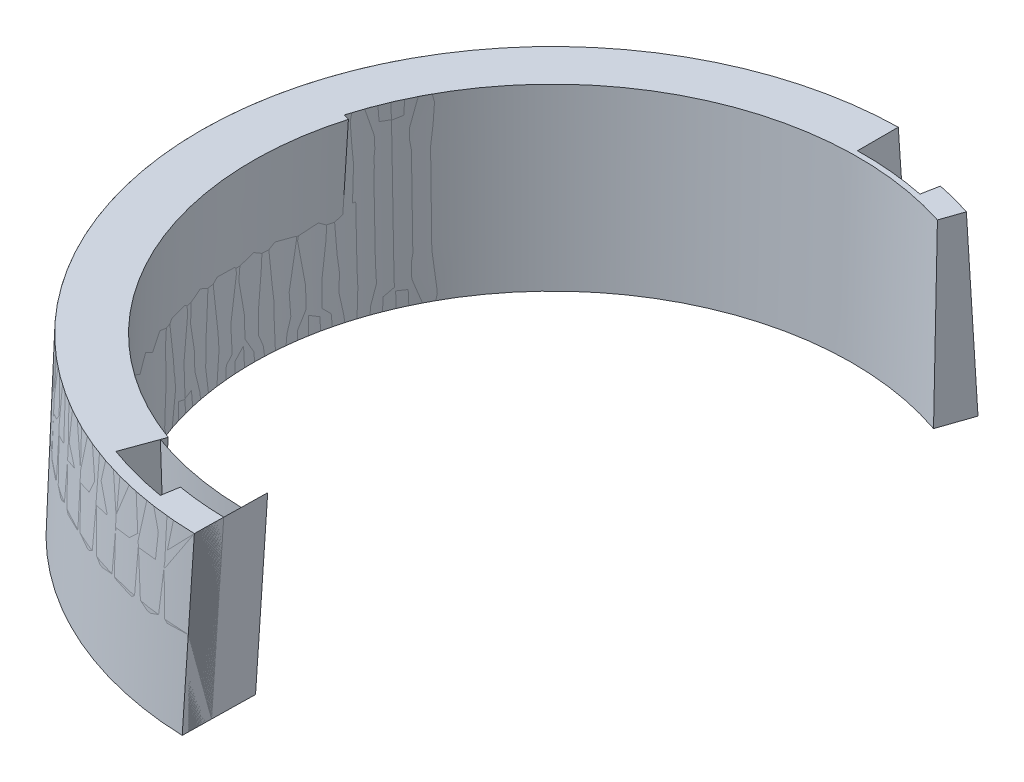
ISO-10303-21;
HEADER;
FILE_DESCRIPTION(('STEP AP214'),'2;1');
FILE_NAME('part.step','',(''),(''),'','','');
FILE_SCHEMA(('AUTOMOTIVE_DESIGN { 1 0 10303 214 1 1 1 1 }'));
ENDSEC;
DATA;
#1=APPLICATION_CONTEXT('core data for automotive mechanical design processes');
#2=APPLICATION_PROTOCOL_DEFINITION('international standard','automotive_design',2000,#1);
#3=PRODUCT_CONTEXT('',#1,'mechanical');
#4=PRODUCT('Part','Part','',(#3));
#5=PRODUCT_RELATED_PRODUCT_CATEGORY('part','',(#4));
#6=PRODUCT_DEFINITION_FORMATION('','',#4);
#7=PRODUCT_DEFINITION_CONTEXT('part definition',#1,'design');
#8=PRODUCT_DEFINITION('design','',#6,#7);
#9=PRODUCT_DEFINITION_SHAPE('','',#8);
#10=(LENGTH_UNIT() NAMED_UNIT(*) SI_UNIT(.MILLI.,.METRE.));
#11=(NAMED_UNIT(*) PLANE_ANGLE_UNIT() SI_UNIT($,.RADIAN.));
#12=(NAMED_UNIT(*) SI_UNIT($,.STERADIAN.) SOLID_ANGLE_UNIT());
#13=UNCERTAINTY_MEASURE_WITH_UNIT(LENGTH_MEASURE(1.E-05),#10,'distance_accuracy_value','');
#14=(GEOMETRIC_REPRESENTATION_CONTEXT(3) GLOBAL_UNCERTAINTY_ASSIGNED_CONTEXT((#13)) GLOBAL_UNIT_ASSIGNED_CONTEXT((#10,
#11,#12)) REPRESENTATION_CONTEXT('',''));
#15=CARTESIAN_POINT('',(0.,0.,0.));
#16=DIRECTION('',(0.,0.,1.));
#17=DIRECTION('',(1.,0.,0.));
#18=AXIS2_PLACEMENT_3D('',#15,#16,#17);
#19=CARTESIAN_POINT('',(-1.90318188336964,0.,49.0057882774836));
#20=DIRECTION('',(-0.999238614955483,0.034899496702501,-0.0174417749028301));
#21=DIRECTION('',(-0.0174524064372834,0.,0.999847695156391));
#22=AXIS2_PLACEMENT_3D('',#19,#20,#21);
#23=PLANE('',#22);
#24=CARTESIAN_POINT('',(-2.1189524065532,-0.000199999999995899,61.3668730888602));
#25=DIRECTION('',(0.0354768345270249,0.998793085918968,-0.0339671272321782));
#26=VECTOR('',#25,1.);
#27=LINE('',#24,#26);
#28=CARTESIAN_POINT('',(-1.05324051777977,30.00317243927,60.3464566306443));
#29=VERTEX_POINT('',#28);
#30=CARTESIAN_POINT('',(-2.11894542346302,0.,61.3668732107505));
#31=VERTEX_POINT('',#30);
#32=EDGE_CURVE('E13',#29,#31,#27,.F.);
#33=ORIENTED_EDGE('',*,*,#32,.F.);
#34=DIRECTION('',(-0.0174300356366719,0.000640610806845889,0.999847880167528));
#35=VECTOR('',#34,1.);
#36=CARTESIAN_POINT('',(-0.83777024428303,29.9952532021191,47.9863272146401));
#37=LINE('',#36,#35);
#38=CARTESIAN_POINT('',(-0.83777024428303,29.9952532021191,47.9863272146401));
#39=VERTEX_POINT('',#38);
#40=EDGE_CURVE('E69',#39,#29,#37,.T.);
#41=ORIENTED_EDGE('',*,*,#40,.F.);
#42=CARTESIAN_POINT('',(-1.90318188336964,0.,49.0057882774836));
#43=CARTESIAN_POINT('',(-1.54809476622768,9.99857083744408,48.6691442612691));
#44=CARTESIAN_POINT('',(-1.19295847097164,19.9969919871956,48.3293833206215));
#45=CARTESIAN_POINT('',(-0.83777024428303,29.9952532021191,47.9863272146401));
#46=B_SPLINE_CURVE_WITH_KNOTS('',3,(#42,#43,#44,#45),.UNSPECIFIED.,.F.,.F.,(4,4),(0.,1.),.UNSPECIFIED.);
#47=CARTESIAN_POINT('',(-1.90318188336964,0.,49.0057882774836));
#48=VERTEX_POINT('',#47);
#49=EDGE_CURVE('E82',#48,#39,#46,.T.);
#50=ORIENTED_EDGE('',*,*,#49,.F.);
#51=DIRECTION('',(-0.0174524064372834,0.,0.999847695156391));
#52=VECTOR('',#51,1.);
#53=CARTESIAN_POINT('',(-1.90318188336964,0.,49.0057882774836));
#54=LINE('',#53,#52);
#55=EDGE_CURVE('E84',#48,#31,#54,.T.);
#56=ORIENTED_EDGE('',*,*,#55,.T.);
#57=EDGE_LOOP('',(#33,#41,#50,#56));
#58=FACE_BOUND('',#57,.T.);
#59=ADVANCED_FACE('F61',(#58),#23,.T.);
#60=OPEN_SHELL('',(#59));
#61=SHELL_BASED_SURFACE_MODEL('B2',(#60));
#62=CARTESIAN_POINT('',(-44.5166832632783,0.,-25.7017190654823));
#63=DIRECTION('',(0.,-1.,0.));
#64=DIRECTION('',(0.500000000000005,0.,0.866025403784436));
#65=AXIS2_PLACEMENT_3D('',#62,#63,#64);
#66=PLANE('',#65);
#67=DIRECTION('',(0.0174524064372834,0.,-0.999847695156391));
#68=VECTOR('',#67,1.);
#69=CARTESIAN_POINT('',(-0.612534177116875,0.,-24.9353692925652));
#70=LINE('',#69,#68);
#71=CARTESIAN_POINT('',(-2.1189453036349,0.,61.3668663458021));
#72=VERTEX_POINT('',#71);
#73=CARTESIAN_POINT('',(-1.94439088881738,0.,51.3666506184266));
#74=VERTEX_POINT('',#73);
#75=EDGE_CURVE('E59',#72,#74,#70,.T.);
#76=ORIENTED_EDGE('',*,*,#75,.F.);
#77=CARTESIAN_POINT('',(0.,0.,0.));
#78=DIRECTION('',(0.,-1.,0.));
#79=DIRECTION('',(0.,0.,-1.));
#80=AXIS2_PLACEMENT_3D('',#77,#78,#79);
#81=CIRCLE('',#80,61.4034381309657);
#82=CARTESIAN_POINT('',(-53.1769373011228,0.,-30.7017190654822));
#83=VERTEX_POINT('',#82);
#84=EDGE_CURVE('E153',#72,#83,#81,.T.);
#85=ORIENTED_EDGE('',*,*,#84,.T.);
#86=DIRECTION('',(0.866025403784445,0.,0.499999999999988));
#87=VECTOR('',#86,1.);
#88=CARTESIAN_POINT('',(-48.8468102822006,0.,-28.2017190654822));
#89=LINE('',#88,#87);
#90=CARTESIAN_POINT('',(-44.5166832632783,0.,-25.7017190654823));
#91=VERTEX_POINT('',#90);
#92=EDGE_CURVE('E151',#83,#91,#89,.T.);
#93=ORIENTED_EDGE('',*,*,#92,.T.);
#94=CARTESIAN_POINT('',(0.,0.,0.));
#95=DIRECTION('',(0.,1.,0.));
#96=DIRECTION('',(0.,0.,1.));
#97=AXIS2_PLACEMENT_3D('',#94,#95,#96);
#98=CIRCLE('',#97,51.4034381309657);
#99=EDGE_CURVE('E138',#91,#74,#98,.T.);
#100=ORIENTED_EDGE('',*,*,#99,.T.);
#101=EDGE_LOOP('',(#76,#85,#93,#100));
#102=FACE_BOUND('',#101,.T.);
#103=ADVANCED_FACE('F133',(#102),#66,.T.);
#104=OPEN_SHELL('',(#103));
#105=SHELL_BASED_SURFACE_MODEL('B7',(#104));
#106=CARTESIAN_POINT('',(0.,0.,0.));
#107=DIRECTION('',(0.,1.,0.));
#108=DIRECTION('',(0.,0.,1.));
#109=AXIS2_PLACEMENT_3D('',#106,#107,#108);
#110=CONICAL_SURFACE('',#109,51.4034381309657,0.0349065850398864);
#111=CARTESIAN_POINT('',(-0.915390377203666,30.0002,52.4430797700226));
#112=CARTESIAN_POINT('',(-0.958718036445249,28.7372238642701,52.3982126700792));
#113=CARTESIAN_POINT('',(-1.00204466642942,27.4742496664586,52.3532900229003));
#114=CARTESIAN_POINT('',(-1.08856897589327,24.952003432216,52.2634644878188));
#115=CARTESIAN_POINT('',(-1.13176666146685,23.6927313843368,52.218561927242));
#116=CARTESIAN_POINT('',(-1.21803307517503,21.1778894498889,52.1287767023697));
#117=CARTESIAN_POINT('',(-1.26110180946016,19.922319551791,52.0838943669193));
#118=CARTESIAN_POINT('',(-1.3471103179441,17.4148819170286,51.9941497277414));
#119=CARTESIAN_POINT('',(-1.39005009833796,16.163014168752,51.9492877543962));
#120=CARTESIAN_POINT('',(-1.47580069962945,13.6629808337016,51.8595839769804));
#121=CARTESIAN_POINT('',(-1.51861152675749,12.4148152352317,51.8147425048368));
#122=CARTESIAN_POINT('',(-1.6041042257118,9.92218619989357,51.7250798682108));
#123=CARTESIAN_POINT('',(-1.6467861037935,8.67772275124415,51.6802590372114));
#124=CARTESIAN_POINT('',(-1.73202091207217,6.19249801558799,51.5906378233631));
#125=CARTESIAN_POINT('',(-1.77457384854025,4.95173671671412,51.5458377755605));
#126=CARTESIAN_POINT('',(-1.85955078542551,2.47391628085725,51.4562582667448));
#127=CARTESIAN_POINT('',(-1.90197479211646,1.23685713191937,51.411479142361));
#128=CARTESIAN_POINT('',(-1.94439774750727,-0.000199999999999847,51.3666433696471));
#129=B_SPLINE_CURVE_WITH_KNOTS('',3,(#111,#112,#113,#114,#115,#116,#117,#118,#119,#120,#121,
#122,#123,#124,#125,#126,#127,#128),.UNSPECIFIED.,.F.,.F.,(4,2,2,2,2,2,2,2,4),(0.,
3.79354603911027,7.57598378449066,11.3473132506852,15.1075344526053,18.8566474055343,
22.5946521251308,26.321548627434,30.0373369288672),.UNSPECIFIED.);
#130=CARTESIAN_POINT('',(-1.94439801169145,0.,51.3666503488027));
#131=VERTEX_POINT('',#130);
#132=CARTESIAN_POINT('',(-0.915390255314303,30.,52.4430727869324));
#133=VERTEX_POINT('',#132);
#134=EDGE_CURVE('E131',#131,#133,#129,.F.);
#135=ORIENTED_EDGE('',*,*,#134,.F.);
#136=CARTESIAN_POINT('',(0.,0.,0.));
#137=DIRECTION('',(0.,1.,0.));
#138=DIRECTION('',(-0.866025403784445,0.,-0.499999999999989));
#139=AXIS2_PLACEMENT_3D('',#136,#137,#138);
#140=CIRCLE('',#139,51.4034381309657);
#141=CARTESIAN_POINT('',(-44.5166832632783,0.,-25.7017190654823));
#142=VERTEX_POINT('',#141);
#143=EDGE_CURVE('E207',#142,#131,#140,.T.);
#144=ORIENTED_EDGE('',*,*,#143,.F.);
#145=DIRECTION('',(-0.0302238507236572,0.999390827019096,-0.0174497483512499));
#146=VECTOR('',#145,1.);
#147=CARTESIAN_POINT('',(-44.5166832632783,0.,-25.7017190654823));
#148=LINE('',#147,#146);
#149=CARTESIAN_POINT('',(-45.423951468265,30.,-26.2255306078585));
#150=VERTEX_POINT('',#149);
#151=EDGE_CURVE('E209',#142,#150,#148,.T.);
#152=ORIENTED_EDGE('',*,*,#151,.T.);
#153=CARTESIAN_POINT('',(0.,30.,0.));
#154=DIRECTION('',(0.,1.,0.));
#155=DIRECTION('',(-0.866025403784445,0.,-0.499999999999989));
#156=AXIS2_PLACEMENT_3D('',#153,#154,#155);
#157=CIRCLE('',#156,52.4510612157182);
#158=EDGE_CURVE('E195',#150,#133,#157,.T.);
#159=ORIENTED_EDGE('',*,*,#158,.T.);
#160=EDGE_LOOP('',(#135,#144,#152,#159));
#161=FACE_BOUND('',#160,.T.);
#162=ADVANCED_FACE('F187',(#161),#110,.F.);
#163=OPEN_SHELL('',(#162));
#164=SHELL_BASED_SURFACE_MODEL('B53',(#163));
#165=CARTESIAN_POINT('',(0.,0.,0.));
#166=DIRECTION('',(0.,-1.,0.));
#167=DIRECTION('',(0.,0.,-1.));
#168=AXIS2_PLACEMENT_3D('',#165,#166,#167);
#169=CONICAL_SURFACE('',#168,61.4034381309657,0.0349065850398864);
#170=CARTESIAN_POINT('',(-1.05334711005952,30.0002,60.3466157020415));
#171=CARTESIAN_POINT('',(-1.09736584973479,28.761104687046,60.3891241090004));
#172=CARTESIAN_POINT('',(-1.14138383017602,27.5220077530814,60.4315860492585));
#173=CARTESIAN_POINT('',(-1.22952900399037,25.0406939682696,60.5165242750664));
#174=CARTESIAN_POINT('',(-1.27365619357689,23.7984771093271,60.5590003280538));
#175=CARTESIAN_POINT('',(-1.36201978951295,21.3109234746008,60.6439666770558));
#176=CARTESIAN_POINT('',(-1.40625619210421,20.0655866907712,60.6864567414179));
#177=CARTESIAN_POINT('',(-1.49483821521687,17.5717932061968,60.7714510100464));
#178=CARTESIAN_POINT('',(-1.53918383200141,16.3233364974547,60.8139549835613));
#179=CARTESIAN_POINT('',(-1.62798428278997,13.8233031630151,60.898976968727));
#180=CARTESIAN_POINT('',(-1.67243911307369,12.5717265293685,60.9414947505238));
#181=CARTESIAN_POINT('',(-1.7614579880194,10.0654533450639,61.0265442511258));
#182=CARTESIAN_POINT('',(-1.80602202897226,8.81075678650444,61.0690757409695));
#183=CARTESIAN_POINT('',(-1.89525932052995,6.29824375234998,61.1541525578969));
#184=CARTESIAN_POINT('',(-1.93993256743206,5.0404272689007,61.1966976569081));
#185=CARTESIAN_POINT('',(-2.02938826356953,2.52167438483392,61.2818015916806));
#186=CARTESIAN_POINT('',(-2.07417070910209,1.26073797640851,61.3243602002502));
#187=CARTESIAN_POINT('',(-2.11895240655318,-0.000199999999999846,61.3668730888602));
#188=B_SPLINE_CURVE_WITH_KNOTS('',3,(#170,#171,#172,#173,#174,#175,#176,#177,#178,#179,#180,
#181,#182,#183,#184,#185,#186,#187),.UNSPECIFIED.,.F.,.F.,(4,2,2,2,2,2,2,2,4),(0.,
3.72181625973164,7.45299399757748,11.1935332240493,14.9434339494396,18.7026961838234,
22.4713199370609,26.2493052187986,30.0366520384721),.UNSPECIFIED.);
#189=CARTESIAN_POINT('',(-2.11895216553918,0.,61.3668661088661));
#190=VERTEX_POINT('',#189);
#191=CARTESIAN_POINT('',(-1.05334711005952,30.0002,60.3466157020415));
#192=VERTEX_POINT('',#191);
#193=EDGE_CURVE('E185',#190,#192,#188,.F.);
#194=ORIENTED_EDGE('',*,*,#193,.F.);
#195=CARTESIAN_POINT('',(0.,0.,0.));
#196=DIRECTION('',(0.,1.,0.));
#197=DIRECTION('',(-0.866025403784445,0.,-0.499999999999989));
#198=AXIS2_PLACEMENT_3D('',#195,#196,#197);
#199=CIRCLE('',#198,61.4034381309657);
#200=CARTESIAN_POINT('',(-53.1769373011228,0.,-30.7017190654822));
#201=VERTEX_POINT('',#200);
#202=EDGE_CURVE('E273',#201,#190,#199,.T.);
#203=ORIENTED_EDGE('',*,*,#202,.F.);
#204=DIRECTION('',(0.0302238507236572,0.999390827019096,0.0174497483512501));
#205=VECTOR('',#204,1.);
#206=CARTESIAN_POINT('',(-53.1769373011228,0.,-30.7017190654822));
#207=LINE('',#206,#205);
#208=CARTESIAN_POINT('',(-52.2696690961362,30.,-30.177907523106));
#209=VERTEX_POINT('',#208);
#210=EDGE_CURVE('E275',#201,#209,#207,.T.);
#211=ORIENTED_EDGE('',*,*,#210,.T.);
#212=CARTESIAN_POINT('',(0.,30.,0.));
#213=DIRECTION('',(0.,1.,0.));
#214=DIRECTION('',(-0.866025403784445,0.,-0.499999999999989));
#215=AXIS2_PLACEMENT_3D('',#212,#213,#214);
#216=CIRCLE('',#215,60.3558150462133);
#217=EDGE_CURVE('E262',#209,#192,#216,.T.);
#218=ORIENTED_EDGE('',*,*,#217,.T.);
#219=EDGE_LOOP('',(#194,#203,#211,#218));
#220=FACE_BOUND('',#219,.T.);
#221=ADVANCED_FACE('F253',(#220),#169,.F.);
#222=OPEN_SHELL('',(#221));
#223=SHELL_BASED_SURFACE_MODEL('B125',(#222));
#224=CARTESIAN_POINT('',(0.,0.,0.));
#225=DIRECTION('',(0.374861570133077,0.034899496702501,0.926423676493254));
#226=DIRECTION('',(0.926988372763554,0.,-0.375090064865999));
#227=AXIS2_PLACEMENT_3D('',#224,#225,#226);
#228=PLANE('',#227);
#229=CARTESIAN_POINT('',(-48.6215277406224,-0.0002,19.6738810476102));
#230=CARTESIAN_POINT('',(-48.5527802093637,3.56720435453582,19.5116751068177));
#231=CARTESIAN_POINT('',(-48.483612596789,7.13459279702392,19.3492997866978));
#232=CARTESIAN_POINT('',(-48.3444372089912,14.2693378587291,19.0242103877654));
#233=CARTESIAN_POINT('',(-48.274429433768,17.8366944779462,18.8614963089529));
#234=CARTESIAN_POINT('',(-48.2040015772285,21.4040351851156,18.6986128508128));
#235=B_SPLINE_CURVE_WITH_KNOTS('',3,(#229,#230,#231,#232,#233,#234),.UNSPECIFIED.,.F.,.F.,(4,2,
4),(0.,10.7152550984706,21.4305101994175),.UNSPECIFIED.);
#236=CARTESIAN_POINT('',(-48.6215238860801,0.,19.6738719536942));
#237=VERTEX_POINT('',#236);
#238=CARTESIAN_POINT('',(-48.3299840617232,15.0000000000001,18.9908372440811));
#239=VERTEX_POINT('',#238);
#240=EDGE_CURVE('E536',#237,#239,#235,.T.);
#241=ORIENTED_EDGE('',*,*,#240,.F.);
#242=DIRECTION('',(0.926988372763554,0.,-0.375090064865999));
#243=VECTOR('',#242,1.);
#244=CARTESIAN_POINT('',(0.,0.,0.));
#245=LINE('',#244,#243);
#246=CARTESIAN_POINT('',(-47.6503894674759,0.,19.2809189428793));
#247=VERTEX_POINT('',#246);
#248=EDGE_CURVE('E627',#237,#247,#245,.T.);
#249=ORIENTED_EDGE('',*,*,#248,.T.);
#250=CARTESIAN_POINT('',(-49.0047775285767,30.,18.6988128508128));
#251=CARTESIAN_POINT('',(-48.780643872918,24.9999404593215,18.7964792529873));
#252=CARTESIAN_POINT('',(-48.5557113733644,19.9999106897313,18.8938212950656));
#253=CARTESIAN_POINT('',(-48.1042486863317,9.99991068973124,19.0878566590882));
#254=CARTESIAN_POINT('',(-47.8777184988518,4.9999404593215,19.184549981032));
#255=CARTESIAN_POINT('',(-47.6503894674759,0.,19.2809189428793));
#256=B_SPLINE_CURVE_WITH_KNOTS('',3,(#250,#251,#252,#253,#254,#255),.UNSPECIFIED.,.F.,.F.,(4,2,
4),(0.,15.0180994201564,30.0361988493114),.UNSPECIFIED.);
#257=EDGE_CURVE('E524',#239,#247,#256,.T.);
#258=ORIENTED_EDGE('',*,*,#257,.F.);
#259=EDGE_LOOP('',(#241,#249,#258));
#260=FACE_BOUND('',#259,.T.);
#261=ADVANCED_FACE('F310',(#260),#228,.T.);
#262=CARTESIAN_POINT('',(0.,0.,0.));
#263=DIRECTION('',(0.,1.,0.));
#264=DIRECTION('',(0.,0.,1.));
#265=AXIS2_PLACEMENT_3D('',#262,#263,#264);
#266=CONICAL_SURFACE('',#265,51.4034381309657,0.0349065850398866);
#267=CARTESIAN_POINT('',(0.,30.,0.));
#268=DIRECTION('',(0.,1.,0.));
#269=DIRECTION('',(0.,0.,1.));
#270=AXIS2_PLACEMENT_3D('',#267,#268,#269);
#271=CIRCLE('',#270,52.4510612157182);
#272=CARTESIAN_POINT('',(16.0824415913698,30.,-49.9246321480208));
#273=VERTEX_POINT('',#272);
#274=CARTESIAN_POINT('',(-50.3609599059894,30.,-14.659042942919));
#275=VERTEX_POINT('',#274);
#276=EDGE_CURVE('E446',#273,#275,#271,.T.);
#277=ORIENTED_EDGE('',*,*,#276,.T.);
#278=CARTESIAN_POINT('',(-50.3609646599001,30.0002,-14.659051600698));
#279=CARTESIAN_POINT('',(-50.2687955663398,26.1222505915084,-14.4911817925866));
#280=CARTESIAN_POINT('',(-50.1761114075856,22.2443200336257,-14.3231627451548));
#281=CARTESIAN_POINT('',(-49.9897129596613,14.488496617922,-13.9868261716003));
#282=CARTESIAN_POINT('',(-49.895998670491,10.6106037601009,-13.8185086454775));
#283=CARTESIAN_POINT('',(-49.8017693161263,6.73272975288886,-13.6500418800343));
#284=B_SPLINE_CURVE_WITH_KNOTS('',3,(#278,#279,#280,#281,#282,#283),.UNSPECIFIED.,.F.,.F.,(4,2,
4),(0.,11.6480253900864,23.2960507836459),.UNSPECIFIED.);
#285=CARTESIAN_POINT('',(-50.0018798350972,15.0000000000001,-14.0089711111877));
#286=VERTEX_POINT('',#285);
#287=EDGE_CURVE('E338',#275,#286,#284,.T.);
#288=ORIENTED_EDGE('',*,*,#287,.T.);
#289=CARTESIAN_POINT('',(0.,15.0000000000001,0.));
#290=DIRECTION('',(0.,-1.,0.));
#291=DIRECTION('',(0.,0.,-1.));
#292=AXIS2_PLACEMENT_3D('',#289,#290,#291);
#293=CIRCLE('',#292,51.927249673342);
#294=EDGE_CURVE('E479',#286,#239,#293,.F.);
#295=ORIENTED_EDGE('',*,*,#294,.T.);
#296=ORIENTED_EDGE('',*,*,#257,.T.);
#297=CARTESIAN_POINT('',(0.,0.,0.));
#298=DIRECTION('',(0.,1.,0.));
#299=DIRECTION('',(0.,0.,1.));
#300=AXIS2_PLACEMENT_3D('',#297,#298,#299);
#301=CIRCLE('',#300,51.4034381309657);
#302=CARTESIAN_POINT('',(16.7353224850512,0.,-48.6029056024983));
#303=VERTEX_POINT('',#302);
#304=EDGE_CURVE('E720',#303,#247,#301,.T.);
#305=ORIENTED_EDGE('',*,*,#304,.F.);
#306=CARTESIAN_POINT('',(16.0824415913698,30.,-49.9246321480208));
#307=CARTESIAN_POINT('',(16.1918184384154,24.9999404593215,-49.7059741341202));
#308=CARTESIAN_POINT('',(16.3009136030622,19.9999106897313,-49.4865012484096));
#309=CARTESIAN_POINT('',(16.518540567623,9.99991068973124,-49.0459257332364));
#310=CARTESIAN_POINT('',(16.6270723675367,4.9999404593215,-48.8248231037728));
#311=CARTESIAN_POINT('',(16.7353224850512,0.,-48.6029056024983));
#312=B_SPLINE_CURVE_WITH_KNOTS('',3,(#306,#307,#308,#309,#310,#311),.UNSPECIFIED.,.F.,.F.,(4,2,
4),(0.,15.0180994201564,30.0361988493114),.UNSPECIFIED.);
#313=EDGE_CURVE('E631',#273,#303,#312,.T.);
#314=ORIENTED_EDGE('',*,*,#313,.F.);
#315=EDGE_LOOP('',(#277,#288,#295,#296,#305,#314));
#316=FACE_BOUND('',#315,.T.);
#317=ADVANCED_FACE('F518',(#316),#266,.F.);
#318=CARTESIAN_POINT('',(0.,0.,0.));
#319=DIRECTION('',(0.,-1.,0.));
#320=DIRECTION('',(0.,0.,1.));
#321=AXIS2_PLACEMENT_3D('',#318,#319,#320);
#322=CONICAL_SURFACE('',#321,54.4034381309657,0.0349065850398866);
#323=CARTESIAN_POINT('',(0.,0.,0.));
#324=DIRECTION('',(0.,1.,0.));
#325=DIRECTION('',(0.,0.,1.));
#326=AXIS2_PLACEMENT_3D('',#323,#324,#325);
#327=CIRCLE('',#326,54.4034381309657);
#328=CARTESIAN_POINT('',(0.,0.,-54.4034381309657));
#329=VERTEX_POINT('',#328);
#330=CARTESIAN_POINT('',(9.91423913637608,0.,-53.492447530624));
#331=VERTEX_POINT('',#330);
#332=EDGE_CURVE('E505',#329,#331,#327,.F.);
#333=ORIENTED_EDGE('',*,*,#332,.F.);
#334=CARTESIAN_POINT('',(-1.04762308475243,30.,-53.3455291952195));
#335=CARTESIAN_POINT('',(-0.873021363737469,25.0000608933826,-53.5235763022949));
#336=CARTESIAN_POINT('',(-0.698418579475277,20.0000913393482,-53.7007589338368));
#337=CARTESIAN_POINT('',(-0.349210884557798,10.0000913393481,-54.0533952457512));
#338=CARTESIAN_POINT('',(-0.174605973902513,5.00006089338253,-54.2288489261247));
#339=CARTESIAN_POINT('',(0.,0.,-54.4034381309657));
#340=B_SPLINE_CURVE_WITH_KNOTS('',3,(#334,#335,#336,#337,#338,#339),.UNSPECIFIED.,.F.,.F.,(4,2,
4),(0.,15.018461246951,30.0369224851831),.UNSPECIFIED.);
#341=CARTESIAN_POINT('',(-1.04762308475243,30.,-53.3455291952195));
#342=VERTEX_POINT('',#341);
#343=EDGE_CURVE('E324',#342,#329,#340,.T.);
#344=ORIENTED_EDGE('',*,*,#343,.F.);
#345=CARTESIAN_POINT('',(0.,30.,0.));
#346=DIRECTION('',(0.,1.,0.));
#347=DIRECTION('',(0.,0.,1.));
#348=AXIS2_PLACEMENT_3D('',#345,#346,#347);
#349=CIRCLE('',#348,53.3558150462133);
#350=CARTESIAN_POINT('',(10.7515310849076,30.,-52.2613392344282));
#351=VERTEX_POINT('',#350);
#352=EDGE_CURVE('E691',#342,#351,#349,.F.);
#353=ORIENTED_EDGE('',*,*,#352,.T.);
#354=CARTESIAN_POINT('',(10.7515310849076,30.,-52.2613392344282));
#355=CARTESIAN_POINT('',(10.6122995939708,25.0000608933826,-52.4682235626186));
#356=CARTESIAN_POINT('',(10.4729095194378,20.0000913393482,-52.6742580847597));
#357=CARTESIAN_POINT('',(10.1938122032604,10.0000913393481,-53.084627516824));
#358=CARTESIAN_POINT('',(10.0541049616162,5.00006089338253,-53.2889624267482));
#359=CARTESIAN_POINT('',(9.91423913637607,0.,-53.492447530624));
#360=B_SPLINE_CURVE_WITH_KNOTS('',3,(#354,#355,#356,#357,#358,#359),.UNSPECIFIED.,.F.,.F.,(4,2,
4),(0.,15.018461246951,30.0369224851831),.UNSPECIFIED.);
#361=EDGE_CURVE('E665',#351,#331,#360,.T.);
#362=ORIENTED_EDGE('',*,*,#361,.T.);
#363=EDGE_LOOP('',(#333,#344,#353,#362));
#364=FACE_BOUND('',#363,.T.);
#365=ADVANCED_FACE('F676',(#364),#322,.T.);
#366=CARTESIAN_POINT('',(0.,0.,0.));
#367=DIRECTION('',(0.999390827019096,0.034899496702501,0.));
#368=DIRECTION('',(-0.034899496702501,0.999390827019096,0.));
#369=AXIS2_PLACEMENT_3D('',#366,#367,#368);
#370=PLANE('',#369);
#371=DIRECTION('',(0.,0.,1.));
#372=VECTOR('',#371,1.);
#373=CARTESIAN_POINT('',(0.,0.,0.));
#374=LINE('',#373,#372);
#375=CARTESIAN_POINT('',(0.,0.,-61.4034381309657));
#376=VERTEX_POINT('',#375);
#377=EDGE_CURVE('E712',#376,#329,#374,.T.);
#378=ORIENTED_EDGE('',*,*,#377,.F.);
#379=CARTESIAN_POINT('',(-1.04762308475243,30.,-60.3467223282674));
#380=CARTESIAN_POINT('',(-0.873021112862397,25.0000537092604,-60.5243683143377));
#381=CARTESIAN_POINT('',(-0.698418203170522,20.0000805633899,-60.7012509576153));
#382=CARTESIAN_POINT('',(-0.349210508253044,10.0000805633898,-61.0534895585141));
#383=CARTESIAN_POINT('',(-0.174605723027441,5.0000537092604,-61.228845516136));
#384=CARTESIAN_POINT('',(0.,0.,-61.4034381309657));
#385=B_SPLINE_CURVE_WITH_KNOTS('',3,(#379,#380,#381,#382,#383,#384),.UNSPECIFIED.,.F.,.F.,(4,2,
4),(0.,15.0184401968025,30.0368803875884),.UNSPECIFIED.);
#386=CARTESIAN_POINT('',(-1.04762308475243,30.,-60.3467223282674));
#387=VERTEX_POINT('',#386);
#388=EDGE_CURVE('E633',#387,#376,#385,.T.);
#389=ORIENTED_EDGE('',*,*,#388,.F.);
#390=DIRECTION('',(0.,0.,1.));
#391=VECTOR('',#390,1.);
#392=CARTESIAN_POINT('',(-1.04762308475243,30.,0.));
#393=LINE('',#392,#391);
#394=EDGE_CURVE('E444',#387,#342,#393,.T.);
#395=ORIENTED_EDGE('',*,*,#394,.T.);
#396=ORIENTED_EDGE('',*,*,#343,.T.);
#397=EDGE_LOOP('',(#378,#389,#395,#396));
#398=FACE_BOUND('',#397,.T.);
#399=ADVANCED_FACE('F680',(#398),#370,.T.);
#400=CARTESIAN_POINT('',(0.,0.,0.));
#401=DIRECTION('',(0.,-1.,0.));
#402=DIRECTION('',(0.,0.,1.));
#403=AXIS2_PLACEMENT_3D('',#400,#401,#402);
#404=CONICAL_SURFACE('',#403,61.4034381309657,0.0349065850398866);
#405=CARTESIAN_POINT('',(0.,0.,0.));
#406=DIRECTION('',(0.,1.,0.));
#407=DIRECTION('',(0.,0.,1.));
#408=AXIS2_PLACEMENT_3D('',#405,#406,#407);
#409=CIRCLE('',#408,61.4034381309657);
#410=CARTESIAN_POINT('',(-56.9202731951115,0.,23.0318195915392));
#411=VERTEX_POINT('',#410);
#412=EDGE_CURVE('E714',#376,#411,#409,.T.);
#413=ORIENTED_EDGE('',*,*,#412,.T.);
#414=CARTESIAN_POINT('',(-56.3336629435095,30.,21.664321573956));
#415=CARTESIAN_POINT('',(-56.4328472421029,25.0000537092604,21.892808816198));
#416=CARTESIAN_POINT('',(-56.5313235790427,20.0000805633899,22.1210106054737));
#417=CARTESIAN_POINT('',(-56.7268603295762,10.0000805633898,22.5768432780012));
#418=CARTESIAN_POINT('',(-56.8239207431703,5.0000537092604,22.8044741612532));
#419=CARTESIAN_POINT('',(-56.9202731951115,0.,23.0318195915393));
#420=B_SPLINE_CURVE_WITH_KNOTS('',3,(#414,#415,#416,#417,#418,#419),.UNSPECIFIED.,.F.,.F.,(4,2,
4),(0.,15.0184401968025,30.0368803875884),.UNSPECIFIED.);
#421=CARTESIAN_POINT('',(-56.6290935295188,14.9999999999997,22.3489306140385));
#422=VERTEX_POINT('',#421);
#423=EDGE_CURVE('E531',#422,#411,#420,.T.);
#424=ORIENTED_EDGE('',*,*,#423,.F.);
#425=CARTESIAN_POINT('',(0.,14.9999999999997,0.));
#426=DIRECTION('',(0.,-1.,0.));
#427=DIRECTION('',(0.,0.,-1.));
#428=AXIS2_PLACEMENT_3D('',#425,#426,#427);
#429=CIRCLE('',#428,60.8796265885895);
#430=CARTESIAN_POINT('',(-1.58618842144229,14.9999999999807,60.8589594049857));
#431=VERTEX_POINT('',#430);
#432=EDGE_CURVE('E331',#422,#431,#429,.F.);
#433=ORIENTED_EDGE('',*,*,#432,.T.);
#434=CARTESIAN_POINT('',(-1.05334711005954,30.0002,60.3466157020415));
#435=CARTESIAN_POINT('',(-1.22795560002416,25.0850928764568,60.5152212962289));
#436=CARTESIAN_POINT('',(-1.40255250684312,20.1699610921106,60.6831139482932));
#437=CARTESIAN_POINT('',(-1.75172315412765,10.3396482035604,61.0174733681161));
#438=CARTESIAN_POINT('',(-1.92629689459322,5.42446709935634,61.1839401358751));
#439=CARTESIAN_POINT('',(-2.10085905191316,0.509261334349333,61.3496939615115));
#440=B_SPLINE_CURVE_WITH_KNOTS('',3,(#434,#435,#436,#437,#438,#439),.UNSPECIFIED.,.F.,.F.,(4,2,
4),(0.,14.7632900235618,29.5265800418733),.UNSPECIFIED.);
#441=CARTESIAN_POINT('',(-1.05335421504003,30.,60.3466225632418));
#442=VERTEX_POINT('',#441);
#443=EDGE_CURVE('E251',#442,#431,#440,.T.);
#444=ORIENTED_EDGE('',*,*,#443,.F.);
#445=CARTESIAN_POINT('',(0.,30.,0.));
#446=DIRECTION('',(0.,1.,0.));
#447=DIRECTION('',(0.,0.,1.));
#448=AXIS2_PLACEMENT_3D('',#445,#446,#447);
#449=CIRCLE('',#448,60.3558150462133);
#450=EDGE_CURVE('E436',#387,#442,#449,.T.);
#451=ORIENTED_EDGE('',*,*,#450,.F.);
#452=ORIENTED_EDGE('',*,*,#388,.T.);
#453=EDGE_LOOP('',(#413,#424,#433,#444,#451,#452));
#454=FACE_BOUND('',#453,.T.);
#455=ADVANCED_FACE('F312',(#454),#404,.T.);
#456=CARTESIAN_POINT('',(-55.9491387765073,0.,22.6388665807243));
#457=VERTEX_POINT('',#456);
#458=EDGE_CURVE('E716',#411,#457,#245,.T.);
#459=ORIENTED_EDGE('',*,*,#458,.T.);
#460=CARTESIAN_POINT('',(-55.9491296825907,-0.0002,22.6388704352669));
#461=CARTESIAN_POINT('',(-56.1117244634894,3.5757977762889,22.5699494983795));
#462=CARTESIAN_POINT('',(-56.2739671466545,7.15180872559785,22.5008855948944));
#463=CARTESIAN_POINT('',(-56.5977483174946,14.3038569697582,22.3624718547383));
#464=CARTESIAN_POINT('',(-56.7592868051698,17.8798942646097,22.2931220180675));
#465=CARTESIAN_POINT('',(-56.9204731951115,21.4559447324811,22.2236292147989));
#466=B_SPLINE_CURVE_WITH_KNOTS('',3,(#460,#461,#462,#463,#464,#465),.UNSPECIFIED.,.F.,.F.,(4,2,
4),(0.,10.7410670505888,21.4821340996829),.UNSPECIFIED.);
#467=EDGE_CURVE('E498',#457,#422,#466,.T.);
#468=ORIENTED_EDGE('',*,*,#467,.T.);
#469=ORIENTED_EDGE('',*,*,#423,.T.);
#470=EDGE_LOOP('',(#459,#468,#469));
#471=FACE_BOUND('',#470,.T.);
#472=ADVANCED_FACE('F513',(#471),#228,.T.);
#473=CARTESIAN_POINT('',(0.,0.,0.));
#474=DIRECTION('',(0.944942591230119,0.034899496702501,0.325369827134019));
#475=DIRECTION('',(0.325568154457157,0.,-0.945518575599317));
#476=AXIS2_PLACEMENT_3D('',#473,#474,#475);
#477=PLANE('',#476);
#478=DIRECTION('',(-0.325568154457157,0.,0.945518575599317));
#479=VECTOR('',#478,1.);
#480=CARTESIAN_POINT('',(0.,0.,0.));
#481=LINE('',#480,#479);
#482=CARTESIAN_POINT('',(18.6887314117941,0.,-54.2760170560942));
#483=VERTEX_POINT('',#482);
#484=EDGE_CURVE('E722',#483,#303,#481,.T.);
#485=ORIENTED_EDGE('',*,*,#484,.F.);
#486=CARTESIAN_POINT('',(17.3539411612331,30.,-53.617335029778));
#487=CARTESIAN_POINT('',(17.5769369491335,25.0000575919434,-53.7286629435812));
#488=CARTESIAN_POINT('',(17.7996673639911,20.0000863872996,-53.8392170693558));
#489=CARTESIAN_POINT('',(18.2445974475112,10.0000863872995,-54.0587777447938));
#490=CARTESIAN_POINT('',(18.4667971161739,5.00005759194337,-54.1677842944579));
#491=CARTESIAN_POINT('',(18.6887314117941,0.,-54.2760170560942));
#492=B_SPLINE_CURVE_WITH_KNOTS('',3,(#486,#487,#488,#489,#490,#491),.UNSPECIFIED.,.F.,.F.,(4,2,
4),(0.,15.0184515812138,30.0369031550322),.UNSPECIFIED.);
#493=CARTESIAN_POINT('',(17.3539411612331,30.,-53.617335029778));
#494=VERTEX_POINT('',#493);
#495=EDGE_CURVE('E634',#494,#483,#492,.T.);
#496=ORIENTED_EDGE('',*,*,#495,.F.);
#497=DIRECTION('',(-0.325568154457157,0.,0.945518575599317));
#498=VECTOR('',#497,1.);
#499=CARTESIAN_POINT('',(-0.990547086860047,30.,-0.341072714269551));
#500=LINE('',#499,#498);
#501=EDGE_CURVE('E697',#494,#273,#500,.T.);
#502=ORIENTED_EDGE('',*,*,#501,.T.);
#503=ORIENTED_EDGE('',*,*,#313,.T.);
#504=EDGE_LOOP('',(#485,#496,#502,#503));
#505=FACE_BOUND('',#504,.T.);
#506=ADVANCED_FACE('F516',(#505),#477,.T.);
#507=CARTESIAN_POINT('',(0.,0.,0.));
#508=DIRECTION('',(0.,-1.,0.));
#509=DIRECTION('',(0.,0.,1.));
#510=AXIS2_PLACEMENT_3D('',#507,#508,#509);
#511=CONICAL_SURFACE('',#510,57.4034381309657,0.0349065850398866);
#512=CARTESIAN_POINT('',(0.,0.,0.));
#513=DIRECTION('',(0.,1.,0.));
#514=DIRECTION('',(0.,0.,1.));
#515=AXIS2_PLACEMENT_3D('',#512,#513,#514);
#516=CIRCLE('',#515,57.4034381309657);
#517=CARTESIAN_POINT('',(10.4609457128525,0.,-56.4422122533159));
#518=VERTEX_POINT('',#517);
#519=EDGE_CURVE('E725',#483,#518,#516,.T.);
#520=ORIENTED_EDGE('',*,*,#519,.T.);
#521=CARTESIAN_POINT('',(11.2983374619385,30.,-55.2116424327257));
#522=CARTESIAN_POINT('',(11.1590722954227,25.0000575919434,-55.4183456963874));
#523=CARTESIAN_POINT('',(11.0196570663904,20.0000863872996,-55.6242448132925));
#524=CARTESIAN_POINT('',(10.7405264833615,10.0000863872995,-56.0344347534884));
#525=CARTESIAN_POINT('',(10.6008111293652,5.00005759194337,-56.2387255767801));
#526=CARTESIAN_POINT('',(10.4609457128525,0.,-56.4422122533159));
#527=B_SPLINE_CURVE_WITH_KNOTS('',3,(#521,#522,#523,#524,#525,#526),.UNSPECIFIED.,.F.,.F.,(4,2,
4),(0.,15.0184515812138,30.0369031550322),.UNSPECIFIED.);
#528=CARTESIAN_POINT('',(11.2983374619385,30.,-55.2116424327257));
#529=VERTEX_POINT('',#528);
#530=EDGE_CURVE('E638',#529,#518,#527,.T.);
#531=ORIENTED_EDGE('',*,*,#530,.F.);
#532=CARTESIAN_POINT('',(0.,30.,0.));
#533=DIRECTION('',(0.,1.,0.));
#534=DIRECTION('',(0.,0.,1.));
#535=AXIS2_PLACEMENT_3D('',#532,#533,#534);
#536=CIRCLE('',#535,56.3558150462133);
#537=EDGE_CURVE('E699',#494,#529,#536,.T.);
#538=ORIENTED_EDGE('',*,*,#537,.F.);
#539=ORIENTED_EDGE('',*,*,#495,.T.);
#540=EDGE_LOOP('',(#520,#531,#538,#539));
#541=FACE_BOUND('',#540,.T.);
#542=ADVANCED_FACE('F650',(#541),#511,.T.);
#543=CARTESIAN_POINT('',(0.,0.,0.));
#544=DIRECTION('',(-0.982655935240925,0.034899496702501,-0.182124512533857));
#545=DIRECTION('',(-0.182235525492148,0.,0.983254907563955));
#546=AXIS2_PLACEMENT_3D('',#543,#544,#545);
#547=PLANE('',#546);
#548=DIRECTION('',(-0.182235525492148,0.,0.983254907563955));
#549=VECTOR('',#548,1.);
#550=CARTESIAN_POINT('',(0.,0.,0.));
#551=LINE('',#550,#549);
#552=EDGE_CURVE('E694',#518,#331,#551,.T.);
#553=ORIENTED_EDGE('',*,*,#552,.T.);
#554=ORIENTED_EDGE('',*,*,#361,.F.);
#555=DIRECTION('',(0.182235525492148,0.,-0.983254907563955));
#556=VECTOR('',#555,1.);
#557=CARTESIAN_POINT('',(1.0300805393601,30.,0.19091414336756));
#558=LINE('',#557,#556);
#559=EDGE_CURVE('E671',#529,#351,#558,.F.);
#560=ORIENTED_EDGE('',*,*,#559,.F.);
#561=ORIENTED_EDGE('',*,*,#530,.T.);
#562=EDGE_LOOP('',(#553,#554,#560,#561));
#563=FACE_BOUND('',#562,.T.);
#564=ADVANCED_FACE('F655',(#563),#547,.T.);
#565=CARTESIAN_POINT('',(0.,30.,0.));
#566=DIRECTION('',(0.,1.,0.));
#567=DIRECTION('',(0.,0.,1.));
#568=AXIS2_PLACEMENT_3D('',#565,#566,#567);
#569=PLANE('',#568);
#570=ORIENTED_EDGE('',*,*,#450,.T.);
#571=DIRECTION('',(-0.0174524064372834,0.,0.999847695156391));
#572=VECTOR('',#571,1.);
#573=CARTESIAN_POINT('',(0.,30.,0.));
#574=LINE('',#573,#572);
#575=CARTESIAN_POINT('',(-0.966923320284498,30.,55.3949999189858));
#576=VERTEX_POINT('',#575);
#577=EDGE_CURVE('E440',#576,#442,#574,.T.);
#578=ORIENTED_EDGE('',*,*,#577,.F.);
#579=CARTESIAN_POINT('',(0.,30.,0.));
#580=DIRECTION('',(0.,1.,0.));
#581=DIRECTION('',(0.,0.,1.));
#582=AXIS2_PLACEMENT_3D('',#579,#580,#581);
#583=CIRCLE('',#582,55.4034381309657);
#584=CARTESIAN_POINT('',(-9.14420481996646,30.,54.6436133042302));
#585=VERTEX_POINT('',#584);
#586=EDGE_CURVE('E454',#576,#585,#583,.F.);
#587=ORIENTED_EDGE('',*,*,#586,.T.);
#588=DIRECTION('',(0.165047605860686,0.,-0.98628560153723));
#589=VECTOR('',#588,1.);
#590=CARTESIAN_POINT('',(0.,30.,0.));
#591=LINE('',#590,#589);
#592=CARTESIAN_POINT('',(-9.63934763754852,30.,57.6024701088419));
#593=VERTEX_POINT('',#592);
#594=EDGE_CURVE('E456',#593,#585,#591,.T.);
#595=ORIENTED_EDGE('',*,*,#594,.F.);
#596=CARTESIAN_POINT('',(0.,30.,0.));
#597=DIRECTION('',(0.,1.,0.));
#598=DIRECTION('',(0.,0.,1.));
#599=AXIS2_PLACEMENT_3D('',#596,#597,#598);
#600=CIRCLE('',#599,58.4034381309657);
#601=CARTESIAN_POINT('',(-19.9751522802651,30.,54.8812798401947));
#602=VERTEX_POINT('',#601);
#603=EDGE_CURVE('E462',#602,#593,#600,.T.);
#604=ORIENTED_EDGE('',*,*,#603,.F.);
#605=DIRECTION('',(0.342020143325675,0.,-0.939692620785906));
#606=VECTOR('',#605,1.);
#607=CARTESIAN_POINT('',(0.,30.,0.));
#608=LINE('',#607,#606);
#609=CARTESIAN_POINT('',(-17.5810112769854,30.,48.3034314946934));
#610=VERTEX_POINT('',#609);
#611=EDGE_CURVE('E464',#602,#610,#608,.T.);
#612=ORIENTED_EDGE('',*,*,#611,.T.);
#613=CARTESIAN_POINT('',(0.,30.,0.));
#614=DIRECTION('',(0.,1.,0.));
#615=DIRECTION('',(0.,0.,1.));
#616=AXIS2_PLACEMENT_3D('',#613,#614,#615);
#617=CIRCLE('',#616,51.4034381309657);
#618=CARTESIAN_POINT('',(-49.3550831335287,30.,-14.3662528366479));
#619=VERTEX_POINT('',#618);
#620=EDGE_CURVE('E467',#619,#610,#617,.T.);
#621=ORIENTED_EDGE('',*,*,#620,.F.);
#622=DIRECTION('',(0.96015140091956,0.,0.279480388063646));
#623=VECTOR('',#622,1.);
#624=CARTESIAN_POINT('',(0.,30.,0.));
#625=LINE('',#624,#623);
#626=EDGE_CURVE('E470',#275,#619,#625,.T.);
#627=ORIENTED_EDGE('',*,*,#626,.F.);
#628=ORIENTED_EDGE('',*,*,#276,.F.);
#629=ORIENTED_EDGE('',*,*,#501,.F.);
#630=ORIENTED_EDGE('',*,*,#537,.T.);
#631=ORIENTED_EDGE('',*,*,#559,.T.);
#632=ORIENTED_EDGE('',*,*,#352,.F.);
#633=ORIENTED_EDGE('',*,*,#394,.F.);
#634=EDGE_LOOP('',(#570,#578,#587,#595,#604,#612,#621,#627,#628,#629,#630,#631,#632,#633));
#635=FACE_BOUND('',#634,.T.);
#636=ADVANCED_FACE('F437',(#635),#569,.T.);
#637=CARTESIAN_POINT('',(0.,0.,0.));
#638=DIRECTION('',(0.,1.,0.));
#639=DIRECTION('',(0.,0.,1.));
#640=AXIS2_PLACEMENT_3D('',#637,#638,#639);
#641=PLANE('',#640);
#642=ORIENTED_EDGE('',*,*,#248,.F.);
#643=CARTESIAN_POINT('',(0.,0.,0.));
#644=DIRECTION('',(0.,1.,0.));
#645=DIRECTION('',(0.,0.,1.));
#646=AXIS2_PLACEMENT_3D('',#643,#644,#645);
#647=CIRCLE('',#646,52.4510612157182);
#648=CARTESIAN_POINT('',(-18.9201844933115,0.,48.9197346823761));
#649=VERTEX_POINT('',#648);
#650=EDGE_CURVE('E573',#237,#649,#647,.T.);
#651=ORIENTED_EDGE('',*,*,#650,.T.);
#652=DIRECTION('',(0.342020143325675,0.,-0.939692620785906));
#653=VECTOR('',#652,1.);
#654=CARTESIAN_POINT('',(-0.984443682106884,0.,-0.358308197598333));
#655=LINE('',#654,#653);
#656=CARTESIAN_POINT('',(-21.3147469321907,0.,55.4987409126706));
#657=VERTEX_POINT('',#656);
#658=EDGE_CURVE('E575',#657,#649,#655,.T.);
#659=ORIENTED_EDGE('',*,*,#658,.F.);
#660=CARTESIAN_POINT('',(0.,0.,0.));
#661=DIRECTION('',(0.,1.,0.));
#662=DIRECTION('',(0.,0.,1.));
#663=AXIS2_PLACEMENT_3D('',#660,#661,#662);
#664=CIRCLE('',#663,59.4510612157182);
#665=CARTESIAN_POINT('',(-8.77747618152844,0.,58.7995288378893));
#666=VERTEX_POINT('',#665);
#667=EDGE_CURVE('E578',#657,#666,#664,.T.);
#668=ORIENTED_EDGE('',*,*,#667,.T.);
#669=DIRECTION('',(-0.165047605860686,0.,0.98628560153723));
#670=VECTOR('',#669,1.);
#671=CARTESIAN_POINT('',(1.0332555643294,0.,0.172907681982786));
#672=LINE('',#671,#670);
#673=CARTESIAN_POINT('',(-8.28225238250266,0.,55.840188107252));
#674=VERTEX_POINT('',#673);
#675=EDGE_CURVE('E580',#666,#674,#672,.F.);
#676=ORIENTED_EDGE('',*,*,#675,.T.);
#677=CARTESIAN_POINT('',(0.,0.,0.));
#678=DIRECTION('',(0.,1.,0.));
#679=DIRECTION('',(0.,0.,1.));
#680=AXIS2_PLACEMENT_3D('',#677,#678,#679);
#681=CIRCLE('',#680,56.4510612157182);
#682=CARTESIAN_POINT('',(-2.03250072252684,0.,56.4144596109339));
#683=VERTEX_POINT('',#682);
#684=EDGE_CURVE('E570',#683,#674,#681,.F.);
#685=ORIENTED_EDGE('',*,*,#684,.F.);
#686=DIRECTION('',(0.0174524064372834,0.,-0.999847695156391));
#687=VECTOR('',#686,1.);
#688=CARTESIAN_POINT('',(-1.04746352668235,0.,-0.01828354386818));
#689=LINE('',#688,#687);
#690=CARTESIAN_POINT('',(-2.10065905191315,0.,60.3192476862927));
#691=VERTEX_POINT('',#690);
#692=EDGE_CURVE('E472',#683,#691,#689,.F.);
#693=ORIENTED_EDGE('',*,*,#692,.T.);
#694=CARTESIAN_POINT('',(0.,0.,0.));
#695=DIRECTION('',(0.,1.,0.));
#696=DIRECTION('',(0.,0.,1.));
#697=AXIS2_PLACEMENT_3D('',#694,#695,#696);
#698=CIRCLE('',#697,60.3558150462133);
#699=EDGE_CURVE('E571',#457,#691,#698,.T.);
#700=ORIENTED_EDGE('',*,*,#699,.F.);
#701=ORIENTED_EDGE('',*,*,#458,.F.);
#702=ORIENTED_EDGE('',*,*,#412,.F.);
#703=ORIENTED_EDGE('',*,*,#377,.T.);
#704=ORIENTED_EDGE('',*,*,#332,.T.);
#705=ORIENTED_EDGE('',*,*,#552,.F.);
#706=ORIENTED_EDGE('',*,*,#519,.F.);
#707=ORIENTED_EDGE('',*,*,#484,.T.);
#708=ORIENTED_EDGE('',*,*,#304,.T.);
#709=EDGE_LOOP('',(#642,#651,#659,#668,#676,#685,#693,#700,#701,#702,#703,#704,#705,#706,#707,#708));
#710=FACE_BOUND('',#709,.T.);
#711=ADVANCED_FACE('F491',(#710),#641,.F.);
#712=CARTESIAN_POINT('',(0.,30.,0.));
#713=DIRECTION('',(0.,1.,0.));
#714=DIRECTION('',(0.,0.,1.));
#715=AXIS2_PLACEMENT_3D('',#712,#713,#714);
#716=CONICAL_SURFACE('',#715,61.4034381309657,0.0349065850398866);
#717=ORIENTED_EDGE('',*,*,#432,.F.);
#718=ORIENTED_EDGE('',*,*,#467,.F.);
#719=ORIENTED_EDGE('',*,*,#699,.T.);
#720=CARTESIAN_POINT('',(-2.10065905191315,0.,60.3192476862927));
#721=CARTESIAN_POINT('',(-1.92918402269999,4.99994629073958,60.4999138405971));
#722=CARTESIAN_POINT('',(-1.75769473365915,9.99991943661014,60.6798167847364));
#723=CARTESIAN_POINT('',(-1.41468763599082,19.9999194366102,61.038096252613));
#724=CARTESIAN_POINT('',(-1.24316982736334,24.9999462907396,61.2164727763508));
#725=CARTESIAN_POINT('',(-1.0716377589082,30.,61.3940860899242));
#726=B_SPLINE_CURVE_WITH_KNOTS('',3,(#720,#721,#722,#723,#724,#725),.UNSPECIFIED.,.F.,.F.,(4,2,
4),(0.,15.0184401968025,30.0368803875884),.UNSPECIFIED.);
#727=EDGE_CURVE('E473',#691,#431,#726,.T.);
#728=ORIENTED_EDGE('',*,*,#727,.T.);
#729=EDGE_LOOP('',(#717,#718,#719,#728));
#730=FACE_BOUND('',#729,.T.);
#731=ADVANCED_FACE('F487',(#730),#716,.T.);
#732=CARTESIAN_POINT('',(0.,30.,0.));
#733=DIRECTION('',(0.,-1.,0.));
#734=DIRECTION('',(0.,0.,1.));
#735=AXIS2_PLACEMENT_3D('',#732,#733,#734);
#736=CONICAL_SURFACE('',#735,51.4034381309657,0.0349065850398866);
#737=ORIENTED_EDGE('',*,*,#650,.F.);
#738=ORIENTED_EDGE('',*,*,#240,.T.);
#739=ORIENTED_EDGE('',*,*,#294,.F.);
#740=CARTESIAN_POINT('',(-50.6437036488404,0.,-13.6502418800343));
#741=CARTESIAN_POINT('',(-50.4305886348222,5.00005954067846,-13.770060962457));
#742=CARTESIAN_POINT('',(-50.2166460849028,10.0000893102687,-13.8896380833683));
#743=CARTESIAN_POINT('',(-49.7871059131332,20.0000893102688,-14.1283084022398));
#744=CARTESIAN_POINT('',(-49.571508291282,25.0000595406785,-14.2474016001997));
#745=CARTESIAN_POINT('',(-49.3550831335287,30.,-14.3662528366479));
#746=B_SPLINE_CURVE_WITH_KNOTS('',3,(#740,#741,#742,#743,#744,#745),.UNSPECIFIED.,.F.,.F.,(4,2,
4),(0.,15.0180994201564,30.0361988493114),.UNSPECIFIED.);
#747=EDGE_CURVE('E480',#286,#619,#746,.T.);
#748=ORIENTED_EDGE('',*,*,#747,.T.);
#749=ORIENTED_EDGE('',*,*,#620,.T.);
#750=CARTESIAN_POINT('',(-18.9201844933115,0.,48.9197346823761));
#751=CARTESIAN_POINT('',(-18.697576771539,5.00005954067846,48.8186385700876));
#752=CARTESIAN_POINT('',(-18.474675142659,10.0000893102687,48.7167319149854));
#753=CARTESIAN_POINT('',(-18.0282840705507,20.0000893102688,48.5112975190921));
#754=CARTESIAN_POINT('',(-17.8047946273219,25.0000595406785,48.4077697783001));
#755=CARTESIAN_POINT('',(-17.5810112769854,30.,48.3034314946933));
#756=B_SPLINE_CURVE_WITH_KNOTS('',3,(#750,#751,#752,#753,#754,#755),.UNSPECIFIED.,.F.,.F.,(4,2,
4),(0.,15.0180994201564,30.0361988493114),.UNSPECIFIED.);
#757=EDGE_CURVE('E557',#649,#610,#756,.T.);
#758=ORIENTED_EDGE('',*,*,#757,.F.);
#759=EDGE_LOOP('',(#737,#738,#739,#748,#749,#758));
#760=FACE_BOUND('',#759,.T.);
#761=ADVANCED_FACE('F490',(#760),#736,.F.);
#762=CARTESIAN_POINT('',(0.,30.,0.));
#763=DIRECTION('',(0.999238614955483,-0.034899496702501,0.0174417749028301));
#764=DIRECTION('',(0.0349048063981253,0.999390641586317,0.));
#765=AXIS2_PLACEMENT_3D('',#762,#763,#764);
#766=PLANE('',#765);
#767=ORIENTED_EDGE('',*,*,#577,.T.);
#768=ORIENTED_EDGE('',*,*,#443,.T.);
#769=ORIENTED_EDGE('',*,*,#727,.F.);
#770=ORIENTED_EDGE('',*,*,#692,.F.);
#771=CARTESIAN_POINT('',(-2.03250072252684,0.,56.4144596109339));
#772=CARTESIAN_POINT('',(-1.85493053607263,5.00005540041998,56.2461527598844));
#773=CARTESIAN_POINT('',(-1.67734732601336,10.0000831000288,56.0770443600513));
#774=CARTESIAN_POINT('',(-1.32215485859926,20.0000831000288,55.7372244627361));
#775=CARTESIAN_POINT('',(-1.14454560124442,25.00005540042,55.5665129652532));
#776=CARTESIAN_POINT('',(-0.966923320284498,30.,55.3949999189858));
#777=B_SPLINE_CURVE_WITH_KNOTS('',3,(#771,#772,#773,#774,#775,#776),.UNSPECIFIED.,.F.,.F.,(4,2,
4),(0.,15.0181121982158,30.0362244036547),.UNSPECIFIED.);
#778=EDGE_CURVE('E453',#683,#576,#777,.T.);
#779=ORIENTED_EDGE('',*,*,#778,.T.);
#780=EDGE_LOOP('',(#767,#768,#769,#770,#779));
#781=FACE_BOUND('',#780,.T.);
#782=ADVANCED_FACE('F451',(#781),#766,.T.);
#783=CARTESIAN_POINT('',(0.,30.,0.));
#784=DIRECTION('',(0.279310136162545,-0.034899496702501,-0.959566502628543));
#785=DIRECTION('',(-0.96015140091956,0.,-0.279480388063646));
#786=AXIS2_PLACEMENT_3D('',#783,#784,#785);
#787=PLANE('',#786);
#788=ORIENTED_EDGE('',*,*,#287,.F.);
#789=ORIENTED_EDGE('',*,*,#626,.T.);
#790=ORIENTED_EDGE('',*,*,#747,.F.);
#791=EDGE_LOOP('',(#788,#789,#790));
#792=FACE_BOUND('',#791,.T.);
#793=ADVANCED_FACE('F551',(#792),#787,.T.);
#794=CARTESIAN_POINT('',(0.,30.,0.));
#795=DIRECTION('',(0.939120185430968,-0.034899496702501,0.341811793895436));
#796=DIRECTION('',(0.342020143325675,0.,-0.939692620785906));
#797=AXIS2_PLACEMENT_3D('',#794,#795,#796);
#798=PLANE('',#797);
#799=ORIENTED_EDGE('',*,*,#611,.F.);
#800=CARTESIAN_POINT('',(-21.3147469321907,0.,55.4987409126706));
#801=CARTESIAN_POINT('',(-21.0920003635762,5.00005265428903,55.3972626187086));
#802=CARTESIAN_POINT('',(-20.8689941916316,10.0000789809186,55.2950683823653));
#803=CARTESIAN_POINT('',(-20.42246264099,20.0000789809186,55.0892480248739));
#804=CARTESIAN_POINT('',(-20.1989372622928,25.0000526542891,54.9856219037252));
#805=CARTESIAN_POINT('',(-19.9751522802651,30.,54.8812798401947));
#806=B_SPLINE_CURVE_WITH_KNOTS('',3,(#800,#801,#802,#803,#804,#805),.UNSPECIFIED.,.F.,.F.,(4,2,
4),(0.,15.0181206592205,30.0362413246276),.UNSPECIFIED.);
#807=EDGE_CURVE('E598',#657,#602,#806,.T.);
#808=ORIENTED_EDGE('',*,*,#807,.F.);
#809=ORIENTED_EDGE('',*,*,#658,.T.);
#810=ORIENTED_EDGE('',*,*,#757,.T.);
#811=EDGE_LOOP('',(#799,#808,#809,#810));
#812=FACE_BOUND('',#811,.T.);
#813=ADVANCED_FACE('F548',(#812),#798,.T.);
#814=CARTESIAN_POINT('',(0.,30.,0.));
#815=DIRECTION('',(0.,-1.,0.));
#816=DIRECTION('',(0.,0.,1.));
#817=AXIS2_PLACEMENT_3D('',#814,#815,#816);
#818=CONICAL_SURFACE('',#817,58.4034381309657,0.0349065850398866);
#819=ORIENTED_EDGE('',*,*,#603,.T.);
#820=CARTESIAN_POINT('',(-8.77747618152844,0.,58.7995288378893));
#821=CARTESIAN_POINT('',(-8.92137462348706,5.00005265428903,58.6015209684072));
#822=CARTESIAN_POINT('',(-9.06514646578661,10.0000789809186,58.4027621395995));
#823=CARTESIAN_POINT('',(-9.35243695112675,20.0000789809186,58.0037425632511));
#824=CARTESIAN_POINT('',(-9.49595559416722,25.0000526542891,57.8034818157096));
#825=CARTESIAN_POINT('',(-9.63934763754852,30.,57.6024701088419));
#826=B_SPLINE_CURVE_WITH_KNOTS('',3,(#820,#821,#822,#823,#824,#825),.UNSPECIFIED.,.F.,.F.,(4,2,
4),(0.,15.0181206592205,30.0362413246276),.UNSPECIFIED.);
#827=EDGE_CURVE('E597',#666,#593,#826,.T.);
#828=ORIENTED_EDGE('',*,*,#827,.F.);
#829=ORIENTED_EDGE('',*,*,#667,.F.);
#830=ORIENTED_EDGE('',*,*,#807,.T.);
#831=EDGE_LOOP('',(#819,#828,#829,#830));
#832=FACE_BOUND('',#831,.T.);
#833=ADVANCED_FACE('F608',(#832),#818,.F.);
#834=CARTESIAN_POINT('',(0.,30.,0.));
#835=DIRECTION('',(-0.985684782997319,-0.034899496702501,-0.164947063318633));
#836=DIRECTION('',(-0.165047605860686,0.,0.98628560153723));
#837=AXIS2_PLACEMENT_3D('',#834,#835,#836);
#838=PLANE('',#837);
#839=ORIENTED_EDGE('',*,*,#594,.T.);
#840=CARTESIAN_POINT('',(-8.28225238250266,0.,55.840188107252));
#841=CARTESIAN_POINT('',(-8.42617765232588,5.00005540041998,55.6423399737408));
#842=CARTESIAN_POINT('',(-8.5699696570089,10.0000831000288,55.4437013400909));
#843=CARTESIAN_POINT('',(-8.85728713616363,20.0000831000288,55.0448430724177));
#844=CARTESIAN_POINT('',(-9.00081261063521,25.00005540042,54.8446234383937));
#845=CARTESIAN_POINT('',(-9.14420481996647,30.,54.6436133042303));
#846=B_SPLINE_CURVE_WITH_KNOTS('',3,(#840,#841,#842,#843,#844,#845),.UNSPECIFIED.,.F.,.F.,(4,2,
4),(0.,15.0181121982158,30.0362244036547),.UNSPECIFIED.);
#847=EDGE_CURVE('E585',#674,#585,#846,.T.);
#848=ORIENTED_EDGE('',*,*,#847,.F.);
#849=ORIENTED_EDGE('',*,*,#675,.F.);
#850=ORIENTED_EDGE('',*,*,#827,.T.);
#851=EDGE_LOOP('',(#839,#848,#849,#850));
#852=FACE_BOUND('',#851,.T.);
#853=ADVANCED_FACE('F595',(#852),#838,.T.);
#854=CARTESIAN_POINT('',(0.,30.,0.));
#855=DIRECTION('',(0.,-1.,0.));
#856=DIRECTION('',(0.,0.,1.));
#857=AXIS2_PLACEMENT_3D('',#854,#855,#856);
#858=CONICAL_SURFACE('',#857,55.4034381309657,0.0349065850398866);
#859=ORIENTED_EDGE('',*,*,#586,.F.);
#860=ORIENTED_EDGE('',*,*,#778,.F.);
#861=ORIENTED_EDGE('',*,*,#684,.T.);
#862=ORIENTED_EDGE('',*,*,#847,.T.);
#863=EDGE_LOOP('',(#859,#860,#861,#862));
#864=FACE_BOUND('',#863,.T.);
#865=ADVANCED_FACE('F493',(#864),#858,.F.);
#866=CLOSED_SHELL('',(#261,#317,#365,#399,#455,#472,#506,#542,#564,#636,#711,#731,#761,#782,
#793,#813,#833,#853,#865));
#867=MANIFOLD_SOLID_BREP('B179',#866);
#868=ADVANCED_BREP_SHAPE_REPRESENTATION('',(#18,#867),#14);
#869=MANIFOLD_SURFACE_SHAPE_REPRESENTATION('',(#18,#61,#105,#164,#223),#14);
#870=SHAPE_REPRESENTATION('',(#18),#14);
#871=SHAPE_DEFINITION_REPRESENTATION(#9,#870);
#872=SHAPE_REPRESENTATION_RELATIONSHIP('','',#870,#868);
#873=SHAPE_REPRESENTATION_RELATIONSHIP('','',#870,#869);
ENDSEC;
END-ISO-10303-21;
